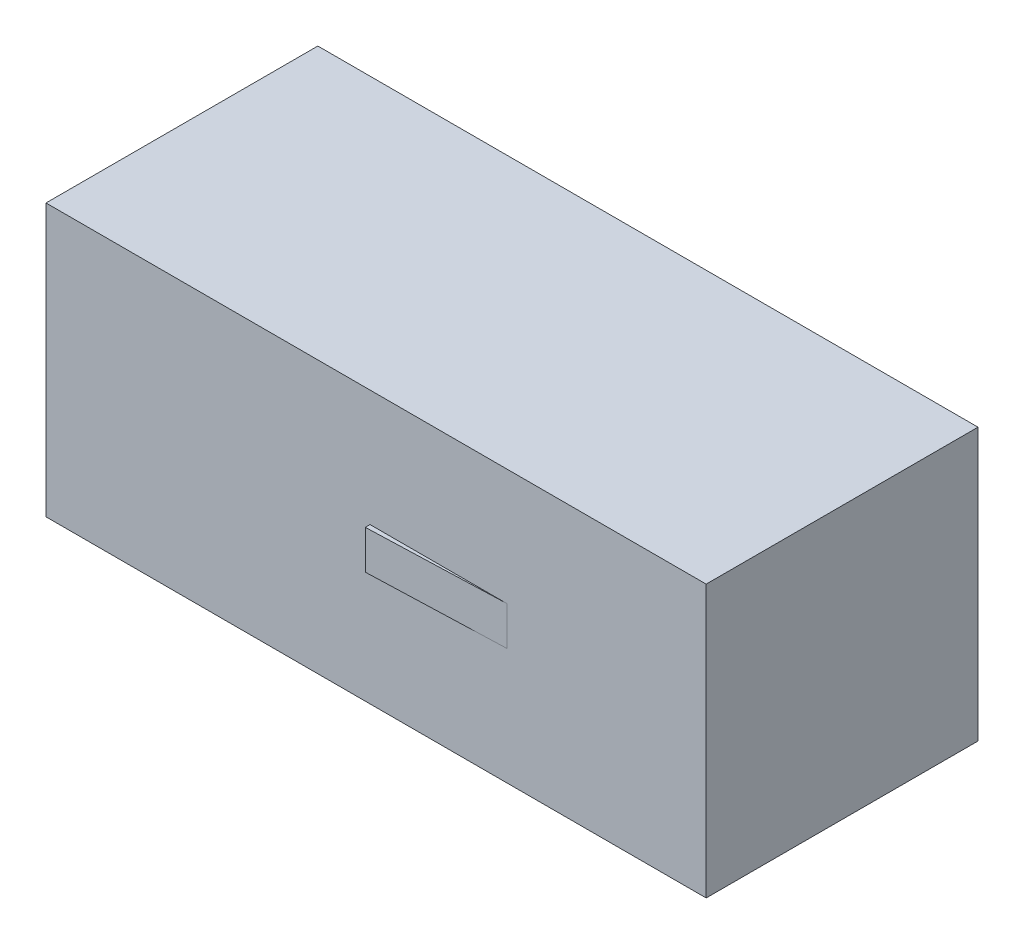
ISO-10303-21;
HEADER;
FILE_DESCRIPTION(('STEP AP214'),'2;1');
FILE_NAME('part.step','',(''),(''),'','','');
FILE_SCHEMA(('AUTOMOTIVE_DESIGN { 1 0 10303 214 1 1 1 1 }'));
ENDSEC;
DATA;
#1=APPLICATION_CONTEXT('core data for automotive mechanical design processes');
#2=APPLICATION_PROTOCOL_DEFINITION('international standard','automotive_design',2000,#1);
#3=PRODUCT_CONTEXT('',#1,'mechanical');
#4=PRODUCT('Part','Part','',(#3));
#5=PRODUCT_RELATED_PRODUCT_CATEGORY('part','',(#4));
#6=PRODUCT_DEFINITION_FORMATION('','',#4);
#7=PRODUCT_DEFINITION_CONTEXT('part definition',#1,'design');
#8=PRODUCT_DEFINITION('design','',#6,#7);
#9=PRODUCT_DEFINITION_SHAPE('','',#8);
#10=(LENGTH_UNIT() NAMED_UNIT(*) SI_UNIT(.MILLI.,.METRE.));
#11=(NAMED_UNIT(*) PLANE_ANGLE_UNIT() SI_UNIT($,.RADIAN.));
#12=(NAMED_UNIT(*) SI_UNIT($,.STERADIAN.) SOLID_ANGLE_UNIT());
#13=UNCERTAINTY_MEASURE_WITH_UNIT(LENGTH_MEASURE(1.E-05),#10,'distance_accuracy_value','');
#14=(GEOMETRIC_REPRESENTATION_CONTEXT(3) GLOBAL_UNCERTAINTY_ASSIGNED_CONTEXT((#13)) GLOBAL_UNIT_ASSIGNED_CONTEXT((#10,
#11,#12)) REPRESENTATION_CONTEXT('',''));
#15=CARTESIAN_POINT('',(0.,0.,0.));
#16=DIRECTION('',(0.,0.,1.));
#17=DIRECTION('',(1.,0.,0.));
#18=AXIS2_PLACEMENT_3D('',#15,#16,#17);
#19=CARTESIAN_POINT('',(0.,0.,35.));
#20=DIRECTION('',(0.,0.,-1.));
#21=DIRECTION('',(-1.,0.,0.));
#22=AXIS2_PLACEMENT_3D('',#19,#20,#21);
#23=PLANE('',#22);
#24=DIRECTION('',(0.,1.,0.));
#25=VECTOR('',#24,1.);
#26=CARTESIAN_POINT('',(85.,-35.,35.));
#27=LINE('',#26,#25);
#28=CARTESIAN_POINT('',(85.,-35.,35.));
#29=VERTEX_POINT('',#28);
#30=CARTESIAN_POINT('',(85.,35.,35.));
#31=VERTEX_POINT('',#30);
#32=EDGE_CURVE('E133',#29,#31,#27,.T.);
#33=ORIENTED_EDGE('',*,*,#32,.T.);
#34=DIRECTION('',(-1.,0.,0.));
#35=VECTOR('',#34,1.);
#36=CARTESIAN_POINT('',(-85.,35.,35.));
#37=LINE('',#36,#35);
#38=CARTESIAN_POINT('',(-85.,35.,35.));
#39=VERTEX_POINT('',#38);
#40=EDGE_CURVE('E88',#31,#39,#37,.T.);
#41=ORIENTED_EDGE('',*,*,#40,.T.);
#42=DIRECTION('',(0.,-1.,0.));
#43=VECTOR('',#42,1.);
#44=CARTESIAN_POINT('',(-85.,-35.,35.));
#45=LINE('',#44,#43);
#46=CARTESIAN_POINT('',(-85.,-35.,35.));
#47=VERTEX_POINT('',#46);
#48=EDGE_CURVE('E136',#39,#47,#45,.T.);
#49=ORIENTED_EDGE('',*,*,#48,.T.);
#50=DIRECTION('',(1.,0.,0.));
#51=VECTOR('',#50,1.);
#52=CARTESIAN_POINT('',(-85.,-35.,35.));
#53=LINE('',#52,#51);
#54=EDGE_CURVE('E60',#47,#29,#53,.T.);
#55=ORIENTED_EDGE('',*,*,#54,.T.);
#56=EDGE_LOOP('',(#33,#41,#49,#55));
#57=FACE_BOUND('',#56,.T.);
#58=DIRECTION('',(1.,0.,0.));
#59=VECTOR('',#58,1.);
#60=CARTESIAN_POINT('',(33.7135514024032,-5.,35.));
#61=LINE('',#60,#59);
#62=CARTESIAN_POINT('',(-1.56901374272389,-5.,35.));
#63=VERTEX_POINT('',#62);
#64=CARTESIAN_POINT('',(33.7135514024032,-5.,35.));
#65=VERTEX_POINT('',#64);
#66=EDGE_CURVE('E114',#63,#65,#61,.T.);
#67=ORIENTED_EDGE('',*,*,#66,.F.);
#68=DIRECTION('',(0.,1.,0.));
#69=VECTOR('',#68,1.);
#70=CARTESIAN_POINT('',(-1.56901374272389,-5.,35.));
#71=LINE('',#70,#69);
#72=CARTESIAN_POINT('',(-1.56901374272389,5.,35.));
#73=VERTEX_POINT('',#72);
#74=EDGE_CURVE('E111',#63,#73,#71,.T.);
#75=ORIENTED_EDGE('',*,*,#74,.T.);
#76=DIRECTION('',(1.,0.,0.));
#77=VECTOR('',#76,1.);
#78=CARTESIAN_POINT('',(33.7135514024032,5.,35.));
#79=LINE('',#78,#77);
#80=CARTESIAN_POINT('',(33.7135514024032,5.,35.));
#81=VERTEX_POINT('',#80);
#82=EDGE_CURVE('E121',#73,#81,#79,.T.);
#83=ORIENTED_EDGE('',*,*,#82,.T.);
#84=DIRECTION('',(0.,1.,0.));
#85=VECTOR('',#84,1.);
#86=CARTESIAN_POINT('',(33.7135514024032,-5.,35.));
#87=LINE('',#86,#85);
#88=EDGE_CURVE('E129',#65,#81,#87,.T.);
#89=ORIENTED_EDGE('',*,*,#88,.F.);
#90=EDGE_LOOP('',(#67,#75,#83,#89));
#91=FACE_BOUND('',#90,.T.);
#92=ADVANCED_FACE('F36',(#57,#91),#23,.F.);
#93=CARTESIAN_POINT('',(85.,-35.,35.));
#94=DIRECTION('',(-1.,0.,0.));
#95=DIRECTION('',(0.,0.,1.));
#96=AXIS2_PLACEMENT_3D('',#93,#94,#95);
#97=PLANE('',#96);
#98=DIRECTION('',(0.,1.,0.));
#99=VECTOR('',#98,1.);
#100=CARTESIAN_POINT('',(85.,-35.,-35.));
#101=LINE('',#100,#99);
#102=CARTESIAN_POINT('',(85.,-35.,-35.));
#103=VERTEX_POINT('',#102);
#104=CARTESIAN_POINT('',(85.,35.,-35.));
#105=VERTEX_POINT('',#104);
#106=EDGE_CURVE('E124',#103,#105,#101,.T.);
#107=ORIENTED_EDGE('',*,*,#106,.T.);
#108=DIRECTION('',(0.,0.,-1.));
#109=VECTOR('',#108,1.);
#110=CARTESIAN_POINT('',(85.,35.,35.));
#111=LINE('',#110,#109);
#112=EDGE_CURVE('E11',#31,#105,#111,.T.);
#113=ORIENTED_EDGE('',*,*,#112,.F.);
#114=ORIENTED_EDGE('',*,*,#32,.F.);
#115=DIRECTION('',(0.,0.,-1.));
#116=VECTOR('',#115,1.);
#117=CARTESIAN_POINT('',(85.,-35.,35.));
#118=LINE('',#117,#116);
#119=EDGE_CURVE('E138',#29,#103,#118,.T.);
#120=ORIENTED_EDGE('',*,*,#119,.T.);
#121=EDGE_LOOP('',(#107,#113,#114,#120));
#122=FACE_BOUND('',#121,.T.);
#123=ADVANCED_FACE('F38',(#122),#97,.F.);
#124=CARTESIAN_POINT('',(-85.,35.,35.));
#125=DIRECTION('',(0.,-1.,0.));
#126=DIRECTION('',(0.,0.,-1.));
#127=AXIS2_PLACEMENT_3D('',#124,#125,#126);
#128=PLANE('',#127);
#129=DIRECTION('',(-1.,0.,0.));
#130=VECTOR('',#129,1.);
#131=CARTESIAN_POINT('',(-85.,35.,-35.));
#132=LINE('',#131,#130);
#133=CARTESIAN_POINT('',(-85.,35.,-35.));
#134=VERTEX_POINT('',#133);
#135=EDGE_CURVE('E127',#105,#134,#132,.T.);
#136=ORIENTED_EDGE('',*,*,#135,.T.);
#137=DIRECTION('',(0.,0.,-1.));
#138=VECTOR('',#137,1.);
#139=CARTESIAN_POINT('',(-85.,35.,35.));
#140=LINE('',#139,#138);
#141=EDGE_CURVE('E44',#39,#134,#140,.T.);
#142=ORIENTED_EDGE('',*,*,#141,.F.);
#143=ORIENTED_EDGE('',*,*,#40,.F.);
#144=ORIENTED_EDGE('',*,*,#112,.T.);
#145=EDGE_LOOP('',(#136,#142,#143,#144));
#146=FACE_BOUND('',#145,.T.);
#147=ADVANCED_FACE('F166',(#146),#128,.F.);
#148=CARTESIAN_POINT('',(-85.,-35.,35.));
#149=DIRECTION('',(1.,0.,0.));
#150=DIRECTION('',(0.,0.,-1.));
#151=AXIS2_PLACEMENT_3D('',#148,#149,#150);
#152=PLANE('',#151);
#153=DIRECTION('',(0.,-1.,0.));
#154=VECTOR('',#153,1.);
#155=CARTESIAN_POINT('',(-85.,-35.,-35.));
#156=LINE('',#155,#154);
#157=CARTESIAN_POINT('',(-85.,-35.,-35.));
#158=VERTEX_POINT('',#157);
#159=EDGE_CURVE('E141',#134,#158,#156,.T.);
#160=ORIENTED_EDGE('',*,*,#159,.T.);
#161=DIRECTION('',(0.,0.,-1.));
#162=VECTOR('',#161,1.);
#163=CARTESIAN_POINT('',(-85.,-35.,35.));
#164=LINE('',#163,#162);
#165=EDGE_CURVE('E145',#47,#158,#164,.T.);
#166=ORIENTED_EDGE('',*,*,#165,.F.);
#167=ORIENTED_EDGE('',*,*,#48,.F.);
#168=ORIENTED_EDGE('',*,*,#141,.T.);
#169=EDGE_LOOP('',(#160,#166,#167,#168));
#170=FACE_BOUND('',#169,.T.);
#171=ADVANCED_FACE('F150',(#170),#152,.F.);
#172=CARTESIAN_POINT('',(-85.,-35.,35.));
#173=DIRECTION('',(0.,1.,0.));
#174=DIRECTION('',(0.,0.,1.));
#175=AXIS2_PLACEMENT_3D('',#172,#173,#174);
#176=PLANE('',#175);
#177=DIRECTION('',(1.,0.,0.));
#178=VECTOR('',#177,1.);
#179=CARTESIAN_POINT('',(-85.,-35.,-35.));
#180=LINE('',#179,#178);
#181=EDGE_CURVE('E81',#158,#103,#180,.T.);
#182=ORIENTED_EDGE('',*,*,#181,.T.);
#183=ORIENTED_EDGE('',*,*,#119,.F.);
#184=ORIENTED_EDGE('',*,*,#54,.F.);
#185=ORIENTED_EDGE('',*,*,#165,.T.);
#186=EDGE_LOOP('',(#182,#183,#184,#185));
#187=FACE_BOUND('',#186,.T.);
#188=ADVANCED_FACE('F158',(#187),#176,.F.);
#189=CARTESIAN_POINT('',(0.,0.,-35.));
#190=DIRECTION('',(0.,0.,-1.));
#191=DIRECTION('',(-1.,0.,0.));
#192=AXIS2_PLACEMENT_3D('',#189,#190,#191);
#193=PLANE('',#192);
#194=ORIENTED_EDGE('',*,*,#106,.F.);
#195=ORIENTED_EDGE('',*,*,#181,.F.);
#196=ORIENTED_EDGE('',*,*,#159,.F.);
#197=ORIENTED_EDGE('',*,*,#135,.F.);
#198=EDGE_LOOP('',(#194,#195,#196,#197));
#199=FACE_BOUND('',#198,.T.);
#200=ADVANCED_FACE('F154',(#199),#193,.T.);
#201=CARTESIAN_POINT('',(-1.5260404650249,-5.,36.2305936645855));
#202=DIRECTION('',(-0.0348994967024936,0.,-0.999390827019096));
#203=DIRECTION('',(-0.999390827019096,0.,0.0348994967024936));
#204=AXIS2_PLACEMENT_3D('',#201,#202,#203);
#205=PLANE('',#204);
#206=DIRECTION('',(-0.999390827019096,0.,0.0348994967024936));
#207=VECTOR('',#206,1.);
#208=CARTESIAN_POINT('',(-1.5260404650249,5.,36.2305936645855));
#209=LINE('',#208,#207);
#210=CARTESIAN_POINT('',(-1.5260404650249,5.,36.2305936645855));
#211=VERTEX_POINT('',#210);
#212=EDGE_CURVE('E51',#81,#211,#209,.T.);
#213=ORIENTED_EDGE('',*,*,#212,.T.);
#214=DIRECTION('',(0.,1.,0.));
#215=VECTOR('',#214,1.);
#216=CARTESIAN_POINT('',(-1.5260404650249,-5.,36.2305936645855));
#217=LINE('',#216,#215);
#218=CARTESIAN_POINT('',(-1.5260404650249,-5.,36.2305936645855));
#219=VERTEX_POINT('',#218);
#220=EDGE_CURVE('E109',#219,#211,#217,.T.);
#221=ORIENTED_EDGE('',*,*,#220,.F.);
#222=DIRECTION('',(-0.999390827019096,0.,0.0348994967024936));
#223=VECTOR('',#222,1.);
#224=CARTESIAN_POINT('',(-1.5260404650249,-5.,36.2305936645855));
#225=LINE('',#224,#223);
#226=EDGE_CURVE('E115',#65,#219,#225,.T.);
#227=ORIENTED_EDGE('',*,*,#226,.F.);
#228=ORIENTED_EDGE('',*,*,#88,.T.);
#229=EDGE_LOOP('',(#213,#221,#227,#228));
#230=FACE_BOUND('',#229,.T.);
#231=ADVANCED_FACE('F123',(#230),#205,.F.);
#232=CARTESIAN_POINT('',(-1.5260404650249,-5.,36.2305936645855));
#233=DIRECTION('',(0.999390827019096,0.,-0.0348994967024973));
#234=DIRECTION('',(-0.0348994967024973,0.,-0.999390827019096));
#235=AXIS2_PLACEMENT_3D('',#232,#233,#234);
#236=PLANE('',#235);
#237=DIRECTION('',(-0.0348994967024973,0.,-0.999390827019096));
#238=VECTOR('',#237,1.);
#239=CARTESIAN_POINT('',(-1.5260404650249,5.,36.2305936645855));
#240=LINE('',#239,#238);
#241=EDGE_CURVE('E256',#211,#73,#240,.T.);
#242=ORIENTED_EDGE('',*,*,#241,.T.);
#243=ORIENTED_EDGE('',*,*,#74,.F.);
#244=DIRECTION('',(-0.0348994967024973,0.,-0.999390827019096));
#245=VECTOR('',#244,1.);
#246=CARTESIAN_POINT('',(-1.5260404650249,-5.,36.2305936645855));
#247=LINE('',#246,#245);
#248=EDGE_CURVE('E105',#219,#63,#247,.T.);
#249=ORIENTED_EDGE('',*,*,#248,.F.);
#250=ORIENTED_EDGE('',*,*,#220,.T.);
#251=EDGE_LOOP('',(#242,#243,#249,#250));
#252=FACE_BOUND('',#251,.T.);
#253=ADVANCED_FACE('F107',(#252),#236,.F.);
#254=CARTESIAN_POINT('',(0.,-5.,0.));
#255=DIRECTION('',(0.,1.,0.));
#256=DIRECTION('',(0.,0.,1.));
#257=AXIS2_PLACEMENT_3D('',#254,#255,#256);
#258=PLANE('',#257);
#259=ORIENTED_EDGE('',*,*,#226,.T.);
#260=ORIENTED_EDGE('',*,*,#248,.T.);
#261=ORIENTED_EDGE('',*,*,#66,.T.);
#262=EDGE_LOOP('',(#259,#260,#261));
#263=FACE_BOUND('',#262,.T.);
#264=ADVANCED_FACE('F118',(#263),#258,.F.);
#265=CARTESIAN_POINT('',(0.,5.,0.));
#266=DIRECTION('',(0.,1.,0.));
#267=DIRECTION('',(0.,0.,1.));
#268=AXIS2_PLACEMENT_3D('',#265,#266,#267);
#269=PLANE('',#268);
#270=ORIENTED_EDGE('',*,*,#212,.F.);
#271=ORIENTED_EDGE('',*,*,#82,.F.);
#272=ORIENTED_EDGE('',*,*,#241,.F.);
#273=EDGE_LOOP('',(#270,#271,#272));
#274=FACE_BOUND('',#273,.T.);
#275=ADVANCED_FACE('F179',(#274),#269,.T.);
#276=CLOSED_SHELL('',(#92,#123,#147,#171,#188,#200,#231,#253,#264,#275));
#277=MANIFOLD_SOLID_BREP('B2',#276);
#278=ADVANCED_BREP_SHAPE_REPRESENTATION('',(#18,#277),#14);
#279=SHAPE_DEFINITION_REPRESENTATION(#9,#278);
ENDSEC;
END-ISO-10303-21;
